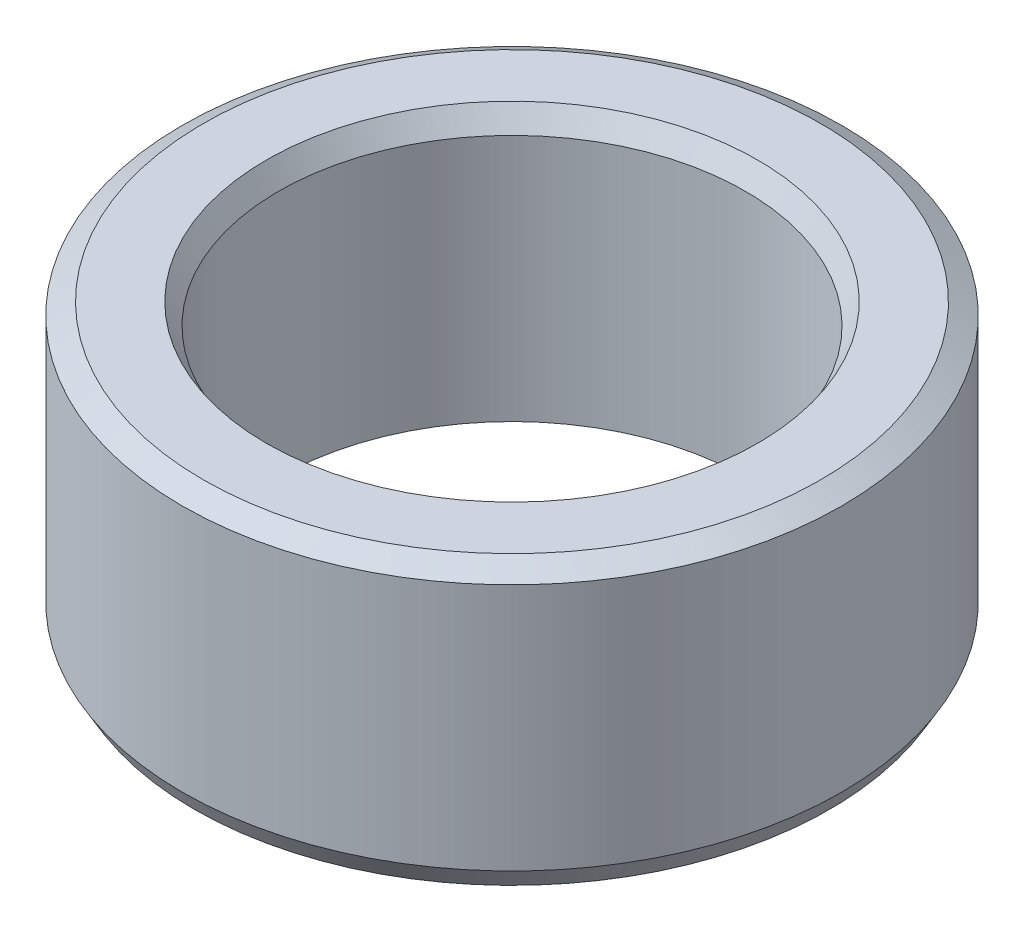
ISO-10303-21;
HEADER;
FILE_DESCRIPTION(('STEP AP214'),'2;1');
FILE_NAME('part.step','',(''),(''),'','','');
FILE_SCHEMA(('AUTOMOTIVE_DESIGN { 1 0 10303 214 1 1 1 1 }'));
ENDSEC;
DATA;
#1=APPLICATION_CONTEXT('core data for automotive mechanical design processes');
#2=APPLICATION_PROTOCOL_DEFINITION('international standard','automotive_design',2000,#1);
#3=PRODUCT_CONTEXT('',#1,'mechanical');
#4=PRODUCT('Part','Part','',(#3));
#5=PRODUCT_RELATED_PRODUCT_CATEGORY('part','',(#4));
#6=PRODUCT_DEFINITION_FORMATION('','',#4);
#7=PRODUCT_DEFINITION_CONTEXT('part definition',#1,'design');
#8=PRODUCT_DEFINITION('design','',#6,#7);
#9=PRODUCT_DEFINITION_SHAPE('','',#8);
#10=(LENGTH_UNIT() NAMED_UNIT(*) SI_UNIT(.MILLI.,.METRE.));
#11=(NAMED_UNIT(*) PLANE_ANGLE_UNIT() SI_UNIT($,.RADIAN.));
#12=(NAMED_UNIT(*) SI_UNIT($,.STERADIAN.) SOLID_ANGLE_UNIT());
#13=UNCERTAINTY_MEASURE_WITH_UNIT(LENGTH_MEASURE(1.E-05),#10,'distance_accuracy_value','');
#14=(GEOMETRIC_REPRESENTATION_CONTEXT(3) GLOBAL_UNCERTAINTY_ASSIGNED_CONTEXT((#13)) GLOBAL_UNIT_ASSIGNED_CONTEXT((#10,
#11,#12)) REPRESENTATION_CONTEXT('',''));
#15=CARTESIAN_POINT('',(0.,0.,0.));
#16=DIRECTION('',(0.,0.,1.));
#17=DIRECTION('',(1.,0.,0.));
#18=AXIS2_PLACEMENT_3D('',#15,#16,#17);
#19=CARTESIAN_POINT('',(0.,25.5709234933483,0.));
#20=DIRECTION('',(0.,-1.,0.));
#21=DIRECTION('',(0.,0.,-1.));
#22=AXIS2_PLACEMENT_3D('',#19,#20,#21);
#23=CYLINDRICAL_SURFACE('',#22,30.);
#24=CARTESIAN_POINT('',(0.,1.9148414020537,0.));
#25=DIRECTION('',(0.,1.,0.));
#26=DIRECTION('',(0.,0.,1.));
#27=AXIS2_PLACEMENT_3D('',#24,#25,#26);
#28=CIRCLE('',#27,30.);
#29=CARTESIAN_POINT('',(0.,1.9148414020537,30.));
#30=VERTEX_POINT('',#29);
#31=EDGE_CURVE('E10',#30,#30,#28,.T.);
#32=ORIENTED_EDGE('',*,*,#31,.T.);
#33=EDGE_LOOP('',(#32));
#34=FACE_BOUND('',#33,.T.);
#35=CARTESIAN_POINT('',(0.,24.4653892944171,0.));
#36=DIRECTION('',(0.,1.,0.));
#37=DIRECTION('',(0.,0.,1.));
#38=AXIS2_PLACEMENT_3D('',#35,#36,#37);
#39=CIRCLE('',#38,30.);
#40=CARTESIAN_POINT('',(0.,24.4653892944171,30.));
#41=VERTEX_POINT('',#40);
#42=EDGE_CURVE('E50',#41,#41,#39,.F.);
#43=ORIENTED_EDGE('',*,*,#42,.T.);
#44=EDGE_LOOP('',(#43));
#45=FACE_BOUND('',#44,.T.);
#46=ADVANCED_FACE('F39',(#34,#45),#23,.T.);
#47=CARTESIAN_POINT('',(0.,25.5709234933483,0.));
#48=DIRECTION('',(0.,1.,0.));
#49=DIRECTION('',(0.,0.,1.));
#50=AXIS2_PLACEMENT_3D('',#47,#48,#49);
#51=PLANE('',#50);
#52=CARTESIAN_POINT('',(0.,25.5709234933483,0.));
#53=DIRECTION('',(0.,1.,0.));
#54=DIRECTION('',(0.,0.,1.));
#55=AXIS2_PLACEMENT_3D('',#52,#53,#54);
#56=CIRCLE('',#55,22.3417998863272);
#57=CARTESIAN_POINT('',(0.,25.5709234933483,22.3417998863272));
#58=VERTEX_POINT('',#57);
#59=EDGE_CURVE('E58',#58,#58,#56,.F.);
#60=ORIENTED_EDGE('',*,*,#59,.T.);
#61=EDGE_LOOP('',(#60));
#62=FACE_BOUND('',#61,.T.);
#63=CARTESIAN_POINT('',(0.,25.5709234933483,0.));
#64=DIRECTION('',(0.,1.,0.));
#65=DIRECTION('',(0.,0.,1.));
#66=AXIS2_PLACEMENT_3D('',#63,#64,#65);
#67=CIRCLE('',#66,28.0851585979463);
#68=CARTESIAN_POINT('',(0.,25.5709234933483,28.0851585979463));
#69=VERTEX_POINT('',#68);
#70=EDGE_CURVE('E61',#69,#69,#67,.T.);
#71=ORIENTED_EDGE('',*,*,#70,.T.);
#72=EDGE_LOOP('',(#71));
#73=FACE_BOUND('',#72,.T.);
#74=ADVANCED_FACE('F88',(#62,#73),#51,.T.);
#75=CARTESIAN_POINT('',(0.,0.,0.));
#76=DIRECTION('',(0.,1.,0.));
#77=DIRECTION('',(0.,0.,1.));
#78=AXIS2_PLACEMENT_3D('',#75,#76,#77);
#79=PLANE('',#78);
#80=CARTESIAN_POINT('',(0.,0.,0.));
#81=DIRECTION('',(0.,1.,0.));
#82=DIRECTION('',(0.,0.,1.));
#83=AXIS2_PLACEMENT_3D('',#80,#81,#82);
#84=CIRCLE('',#83,23.1511070894497);
#85=CARTESIAN_POINT('',(0.,0.,23.1511070894497));
#86=VERTEX_POINT('',#85);
#87=EDGE_CURVE('E51',#86,#86,#84,.T.);
#88=ORIENTED_EDGE('',*,*,#87,.T.);
#89=EDGE_LOOP('',(#88));
#90=FACE_BOUND('',#89,.T.);
#91=CARTESIAN_POINT('',(0.,0.,0.));
#92=DIRECTION('',(0.,1.,0.));
#93=DIRECTION('',(0.,0.,1.));
#94=AXIS2_PLACEMENT_3D('',#91,#92,#93);
#95=CIRCLE('',#94,28.8944658010689);
#96=CARTESIAN_POINT('',(0.,0.,28.8944658010689));
#97=VERTEX_POINT('',#96);
#98=EDGE_CURVE('E54',#97,#97,#95,.F.);
#99=ORIENTED_EDGE('',*,*,#98,.T.);
#100=EDGE_LOOP('',(#99));
#101=FACE_BOUND('',#100,.T.);
#102=ADVANCED_FACE('F83',(#90,#101),#79,.F.);
#103=CARTESIAN_POINT('',(0.,25.5709234933483,0.));
#104=DIRECTION('',(0.,-1.,0.));
#105=DIRECTION('',(0.,0.,-1.));
#106=AXIS2_PLACEMENT_3D('',#103,#104,#105);
#107=CYLINDRICAL_SURFACE('',#106,21.236265687396);
#108=CARTESIAN_POINT('',(0.,23.6560820912946,0.));
#109=DIRECTION('',(0.,1.,0.));
#110=DIRECTION('',(0.,0.,1.));
#111=AXIS2_PLACEMENT_3D('',#108,#109,#110);
#112=CIRCLE('',#111,21.236265687396);
#113=CARTESIAN_POINT('',(0.,23.6560820912946,21.236265687396));
#114=VERTEX_POINT('',#113);
#115=EDGE_CURVE('E67',#114,#114,#112,.T.);
#116=ORIENTED_EDGE('',*,*,#115,.T.);
#117=EDGE_LOOP('',(#116));
#118=FACE_BOUND('',#117,.T.);
#119=CARTESIAN_POINT('',(0.,1.10553419893115,0.));
#120=DIRECTION('',(0.,1.,0.));
#121=DIRECTION('',(0.,0.,1.));
#122=AXIS2_PLACEMENT_3D('',#119,#120,#121);
#123=CIRCLE('',#122,21.236265687396);
#124=CARTESIAN_POINT('',(0.,1.10553419893115,21.236265687396));
#125=VERTEX_POINT('',#124);
#126=EDGE_CURVE('E69',#125,#125,#123,.F.);
#127=ORIENTED_EDGE('',*,*,#126,.T.);
#128=EDGE_LOOP('',(#127));
#129=FACE_BOUND('',#128,.T.);
#130=ADVANCED_FACE('F71',(#118,#129),#107,.F.);
#131=CARTESIAN_POINT('',(0.,23.6560820912946,0.));
#132=DIRECTION('',(0.,1.,0.));
#133=DIRECTION('',(0.,0.,1.));
#134=AXIS2_PLACEMENT_3D('',#131,#132,#133);
#135=CONICAL_SURFACE('',#134,21.236265687396,0.523598775598306);
#136=ORIENTED_EDGE('',*,*,#59,.F.);
#137=EDGE_LOOP('',(#136));
#138=FACE_BOUND('',#137,.T.);
#139=ORIENTED_EDGE('',*,*,#115,.F.);
#140=EDGE_LOOP('',(#139));
#141=FACE_BOUND('',#140,.T.);
#142=ADVANCED_FACE('F77',(#138,#141),#135,.F.);
#143=CARTESIAN_POINT('',(0.,0.,0.));
#144=DIRECTION('',(0.,-1.,0.));
#145=DIRECTION('',(0.,0.,-1.));
#146=AXIS2_PLACEMENT_3D('',#143,#144,#145);
#147=CONICAL_SURFACE('',#146,23.1511070894497,1.0471975511966);
#148=ORIENTED_EDGE('',*,*,#126,.F.);
#149=EDGE_LOOP('',(#148));
#150=FACE_BOUND('',#149,.T.);
#151=ORIENTED_EDGE('',*,*,#87,.F.);
#152=EDGE_LOOP('',(#151));
#153=FACE_BOUND('',#152,.T.);
#154=ADVANCED_FACE('F73',(#150,#153),#147,.F.);
#155=CARTESIAN_POINT('',(0.,1.9148414020537,0.));
#156=DIRECTION('',(0.,1.,0.));
#157=DIRECTION('',(0.,0.,1.));
#158=AXIS2_PLACEMENT_3D('',#155,#156,#157);
#159=CONICAL_SURFACE('',#158,30.,0.523598775598301);
#160=ORIENTED_EDGE('',*,*,#98,.F.);
#161=EDGE_LOOP('',(#160));
#162=FACE_BOUND('',#161,.T.);
#163=ORIENTED_EDGE('',*,*,#31,.F.);
#164=EDGE_LOOP('',(#163));
#165=FACE_BOUND('',#164,.T.);
#166=ADVANCED_FACE('F76',(#162,#165),#159,.T.);
#167=CARTESIAN_POINT('',(0.,25.5709234933483,0.));
#168=DIRECTION('',(0.,-1.,0.));
#169=DIRECTION('',(0.,0.,-1.));
#170=AXIS2_PLACEMENT_3D('',#167,#168,#169);
#171=CONICAL_SURFACE('',#170,28.0851585979463,1.0471975511966);
#172=ORIENTED_EDGE('',*,*,#42,.F.);
#173=EDGE_LOOP('',(#172));
#174=FACE_BOUND('',#173,.T.);
#175=ORIENTED_EDGE('',*,*,#70,.F.);
#176=EDGE_LOOP('',(#175));
#177=FACE_BOUND('',#176,.T.);
#178=ADVANCED_FACE('F45',(#174,#177),#171,.T.);
#179=CLOSED_SHELL('',(#46,#74,#102,#130,#142,#154,#166,#178));
#180=MANIFOLD_SOLID_BREP('B2',#179);
#181=ADVANCED_BREP_SHAPE_REPRESENTATION('',(#18,#180),#14);
#182=SHAPE_DEFINITION_REPRESENTATION(#9,#181);
ENDSEC;
END-ISO-10303-21;
